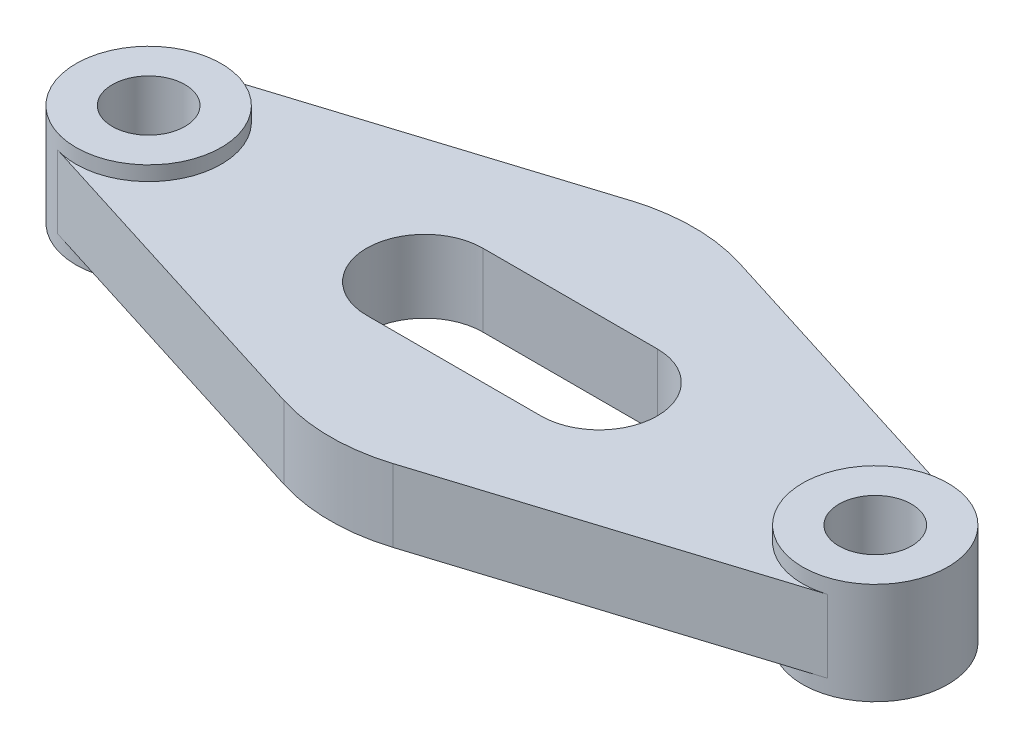
ISO-10303-21;
HEADER;
FILE_DESCRIPTION(('STEP AP214'),'2;1');
FILE_NAME('part.step','',(''),(''),'','','');
FILE_SCHEMA(('AUTOMOTIVE_DESIGN { 1 0 10303 214 1 1 1 1 }'));
ENDSEC;
DATA;
#1=APPLICATION_CONTEXT('core data for automotive mechanical design processes');
#2=APPLICATION_PROTOCOL_DEFINITION('international standard','automotive_design',2000,#1);
#3=PRODUCT_CONTEXT('',#1,'mechanical');
#4=PRODUCT('Part','Part','',(#3));
#5=PRODUCT_RELATED_PRODUCT_CATEGORY('part','',(#4));
#6=PRODUCT_DEFINITION_FORMATION('','',#4);
#7=PRODUCT_DEFINITION_CONTEXT('part definition',#1,'design');
#8=PRODUCT_DEFINITION('design','',#6,#7);
#9=PRODUCT_DEFINITION_SHAPE('','',#8);
#10=(LENGTH_UNIT() NAMED_UNIT(*) SI_UNIT(.MILLI.,.METRE.));
#11=(NAMED_UNIT(*) PLANE_ANGLE_UNIT() SI_UNIT($,.RADIAN.));
#12=(NAMED_UNIT(*) SI_UNIT($,.STERADIAN.) SOLID_ANGLE_UNIT());
#13=UNCERTAINTY_MEASURE_WITH_UNIT(LENGTH_MEASURE(1.E-05),#10,'distance_accuracy_value','');
#14=(GEOMETRIC_REPRESENTATION_CONTEXT(3) GLOBAL_UNCERTAINTY_ASSIGNED_CONTEXT((#13)) GLOBAL_UNIT_ASSIGNED_CONTEXT((#10,
#11,#12)) REPRESENTATION_CONTEXT('',''));
#15=CARTESIAN_POINT('',(0.,0.,0.));
#16=DIRECTION('',(0.,0.,1.));
#17=DIRECTION('',(1.,0.,0.));
#18=AXIS2_PLACEMENT_3D('',#15,#16,#17);
#19=CARTESIAN_POINT('',(-7.50000000000001,-5.,23.8484800354236));
#20=DIRECTION('',(-0.3,0.,0.953939201416946));
#21=DIRECTION('',(0.953939201416946,0.,0.3));
#22=AXIS2_PLACEMENT_3D('',#19,#20,#21);
#23=PLANE('',#22);
#24=DIRECTION('',(0.,1.,0.));
#25=VECTOR('',#24,1.);
#26=CARTESIAN_POINT('',(-7.50000000000001,-5.,23.8484800354236));
#27=LINE('',#26,#25);
#28=CARTESIAN_POINT('',(-7.50000000000001,-5.,23.8484800354236));
#29=VERTEX_POINT('',#28);
#30=CARTESIAN_POINT('',(-7.50000000000001,5.,23.8484800354236));
#31=VERTEX_POINT('',#30);
#32=EDGE_CURVE('E230',#29,#31,#27,.T.);
#33=ORIENTED_EDGE('',*,*,#32,.T.);
#34=DIRECTION('',(0.953939201416946,0.,0.3));
#35=VECTOR('',#34,1.);
#36=CARTESIAN_POINT('',(-7.50000000000001,5.,23.8484800354236));
#37=LINE('',#36,#35);
#38=CARTESIAN_POINT('',(-53.,5.,9.53939201416946));
#39=VERTEX_POINT('',#38);
#40=EDGE_CURVE('E276',#39,#31,#37,.T.);
#41=ORIENTED_EDGE('',*,*,#40,.F.);
#42=DIRECTION('',(0.,1.,0.));
#43=VECTOR('',#42,1.);
#44=CARTESIAN_POINT('',(-53.,-5.,9.53939201416946));
#45=LINE('',#44,#43);
#46=CARTESIAN_POINT('',(-53.,-5.,9.53939201416946));
#47=VERTEX_POINT('',#46);
#48=EDGE_CURVE('E11',#47,#39,#45,.T.);
#49=ORIENTED_EDGE('',*,*,#48,.F.);
#50=DIRECTION('',(0.953939201416946,0.,0.3));
#51=VECTOR('',#50,1.);
#52=CARTESIAN_POINT('',(-7.50000000000001,-5.,23.8484800354236));
#53=LINE('',#52,#51);
#54=EDGE_CURVE('E194',#47,#29,#53,.T.);
#55=ORIENTED_EDGE('',*,*,#54,.T.);
#56=EDGE_LOOP('',(#33,#41,#49,#55));
#57=FACE_BOUND('',#56,.T.);
#58=ADVANCED_FACE('F41',(#57),#23,.T.);
#59=CARTESIAN_POINT('',(-7.5,-5.,-23.8484800354236));
#60=DIRECTION('',(0.3,0.,0.953939201416946));
#61=DIRECTION('',(0.953939201416946,0.,-0.3));
#62=AXIS2_PLACEMENT_3D('',#59,#60,#61);
#63=PLANE('',#62);
#64=DIRECTION('',(0.,1.,0.));
#65=VECTOR('',#64,1.);
#66=CARTESIAN_POINT('',(-53.,-5.,-9.53939201416945));
#67=LINE('',#66,#65);
#68=CARTESIAN_POINT('',(-53.,-5.,-9.53939201416945));
#69=VERTEX_POINT('',#68);
#70=CARTESIAN_POINT('',(-53.,5.,-9.53939201416945));
#71=VERTEX_POINT('',#70);
#72=EDGE_CURVE('E51',#69,#71,#67,.T.);
#73=ORIENTED_EDGE('',*,*,#72,.T.);
#74=DIRECTION('',(0.953939201416946,0.,-0.3));
#75=VECTOR('',#74,1.);
#76=CARTESIAN_POINT('',(-7.5,5.,-23.8484800354236));
#77=LINE('',#76,#75);
#78=CARTESIAN_POINT('',(-7.5,5.,-23.8484800354236));
#79=VERTEX_POINT('',#78);
#80=EDGE_CURVE('E172',#71,#79,#77,.T.);
#81=ORIENTED_EDGE('',*,*,#80,.T.);
#82=DIRECTION('',(0.,1.,0.));
#83=VECTOR('',#82,1.);
#84=CARTESIAN_POINT('',(-7.5,-5.,-23.8484800354236));
#85=LINE('',#84,#83);
#86=CARTESIAN_POINT('',(-7.5,-5.,-23.8484800354236));
#87=VERTEX_POINT('',#86);
#88=EDGE_CURVE('E220',#87,#79,#85,.T.);
#89=ORIENTED_EDGE('',*,*,#88,.F.);
#90=DIRECTION('',(0.953939201416946,0.,-0.3));
#91=VECTOR('',#90,1.);
#92=CARTESIAN_POINT('',(-7.5,-5.,-23.8484800354236));
#93=LINE('',#92,#91);
#94=EDGE_CURVE('E65',#69,#87,#93,.T.);
#95=ORIENTED_EDGE('',*,*,#94,.F.);
#96=EDGE_LOOP('',(#73,#81,#89,#95));
#97=FACE_BOUND('',#96,.T.);
#98=ADVANCED_FACE('F291',(#97),#63,.F.);
#99=CARTESIAN_POINT('',(0.,-5.,0.));
#100=DIRECTION('',(0.,1.,0.));
#101=DIRECTION('',(0.,0.,1.));
#102=AXIS2_PLACEMENT_3D('',#99,#100,#101);
#103=CYLINDRICAL_SURFACE('',#102,25.);
#104=ORIENTED_EDGE('',*,*,#88,.T.);
#105=CARTESIAN_POINT('',(0.,5.,0.));
#106=DIRECTION('',(0.,1.,0.));
#107=DIRECTION('',(0.,0.,1.));
#108=AXIS2_PLACEMENT_3D('',#105,#106,#107);
#109=CIRCLE('',#108,25.);
#110=CARTESIAN_POINT('',(7.5,5.,-23.8484800354236));
#111=VERTEX_POINT('',#110);
#112=EDGE_CURVE('E165',#111,#79,#109,.T.);
#113=ORIENTED_EDGE('',*,*,#112,.F.);
#114=DIRECTION('',(0.,1.,0.));
#115=VECTOR('',#114,1.);
#116=CARTESIAN_POINT('',(7.5,-5.,-23.8484800354236));
#117=LINE('',#116,#115);
#118=CARTESIAN_POINT('',(7.5,-5.,-23.8484800354236));
#119=VERTEX_POINT('',#118);
#120=EDGE_CURVE('E223',#119,#111,#117,.T.);
#121=ORIENTED_EDGE('',*,*,#120,.F.);
#122=CARTESIAN_POINT('',(0.,-5.,0.));
#123=DIRECTION('',(0.,1.,0.));
#124=DIRECTION('',(0.,0.,1.));
#125=AXIS2_PLACEMENT_3D('',#122,#123,#124);
#126=CIRCLE('',#125,25.);
#127=EDGE_CURVE('E209',#119,#87,#126,.T.);
#128=ORIENTED_EDGE('',*,*,#127,.T.);
#129=EDGE_LOOP('',(#104,#113,#121,#128));
#130=FACE_BOUND('',#129,.T.);
#131=ADVANCED_FACE('F316',(#130),#103,.T.);
#132=CARTESIAN_POINT('',(7.5,-5.,-23.8484800354236));
#133=DIRECTION('',(-0.3,0.,0.953939201416946));
#134=DIRECTION('',(0.953939201416946,0.,0.3));
#135=AXIS2_PLACEMENT_3D('',#132,#133,#134);
#136=PLANE('',#135);
#137=ORIENTED_EDGE('',*,*,#120,.T.);
#138=DIRECTION('',(0.953939201416946,0.,0.3));
#139=VECTOR('',#138,1.);
#140=CARTESIAN_POINT('',(7.5,5.,-23.8484800354236));
#141=LINE('',#140,#139);
#142=CARTESIAN_POINT('',(53.,5.,-9.53939201416945));
#143=VERTEX_POINT('',#142);
#144=EDGE_CURVE('E162',#111,#143,#141,.T.);
#145=ORIENTED_EDGE('',*,*,#144,.T.);
#146=DIRECTION('',(0.,1.,0.));
#147=VECTOR('',#146,1.);
#148=CARTESIAN_POINT('',(53.,-5.,-9.53939201416945));
#149=LINE('',#148,#147);
#150=CARTESIAN_POINT('',(53.,-5.,-9.53939201416945));
#151=VERTEX_POINT('',#150);
#152=EDGE_CURVE('E155',#151,#143,#149,.T.);
#153=ORIENTED_EDGE('',*,*,#152,.F.);
#154=DIRECTION('',(0.953939201416946,0.,0.3));
#155=VECTOR('',#154,1.);
#156=CARTESIAN_POINT('',(7.5,-5.,-23.8484800354236));
#157=LINE('',#156,#155);
#158=EDGE_CURVE('E206',#119,#151,#157,.T.);
#159=ORIENTED_EDGE('',*,*,#158,.F.);
#160=EDGE_LOOP('',(#137,#145,#153,#159));
#161=FACE_BOUND('',#160,.T.);
#162=ADVANCED_FACE('F288',(#161),#136,.F.);
#163=CARTESIAN_POINT('',(7.49999999999999,-5.,23.8484800354236));
#164=DIRECTION('',(0.3,0.,0.953939201416946));
#165=DIRECTION('',(0.953939201416946,0.,-0.3));
#166=AXIS2_PLACEMENT_3D('',#163,#164,#165);
#167=PLANE('',#166);
#168=DIRECTION('',(0.,1.,0.));
#169=VECTOR('',#168,1.);
#170=CARTESIAN_POINT('',(53.,-5.,9.53939201416945));
#171=LINE('',#170,#169);
#172=CARTESIAN_POINT('',(53.,-5.,9.53939201416945));
#173=VERTEX_POINT('',#172);
#174=CARTESIAN_POINT('',(53.,5.,9.53939201416946));
#175=VERTEX_POINT('',#174);
#176=EDGE_CURVE('E148',#173,#175,#171,.T.);
#177=ORIENTED_EDGE('',*,*,#176,.T.);
#178=DIRECTION('',(0.953939201416946,0.,-0.3));
#179=VECTOR('',#178,1.);
#180=CARTESIAN_POINT('',(7.49999999999999,5.,23.8484800354236));
#181=LINE('',#180,#179);
#182=CARTESIAN_POINT('',(7.49999999999999,5.,23.8484800354236));
#183=VERTEX_POINT('',#182);
#184=EDGE_CURVE('E133',#183,#175,#181,.T.);
#185=ORIENTED_EDGE('',*,*,#184,.F.);
#186=DIRECTION('',(0.,1.,0.));
#187=VECTOR('',#186,1.);
#188=CARTESIAN_POINT('',(7.49999999999999,-5.,23.8484800354236));
#189=LINE('',#188,#187);
#190=CARTESIAN_POINT('',(7.49999999999999,-5.,23.8484800354236));
#191=VERTEX_POINT('',#190);
#192=EDGE_CURVE('E156',#191,#183,#189,.T.);
#193=ORIENTED_EDGE('',*,*,#192,.F.);
#194=DIRECTION('',(0.953939201416946,0.,-0.3));
#195=VECTOR('',#194,1.);
#196=CARTESIAN_POINT('',(7.49999999999999,-5.,23.8484800354236));
#197=LINE('',#196,#195);
#198=EDGE_CURVE('E151',#191,#173,#197,.T.);
#199=ORIENTED_EDGE('',*,*,#198,.T.);
#200=EDGE_LOOP('',(#177,#185,#193,#199));
#201=FACE_BOUND('',#200,.T.);
#202=ADVANCED_FACE('F149',(#201),#167,.T.);
#203=CARTESIAN_POINT('',(-12.,-5.,0.));
#204=DIRECTION('',(0.,1.,0.));
#205=DIRECTION('',(0.,0.,1.));
#206=AXIS2_PLACEMENT_3D('',#203,#204,#205);
#207=CYLINDRICAL_SURFACE('',#206,8.);
#208=DIRECTION('',(0.,1.,0.));
#209=VECTOR('',#208,1.);
#210=CARTESIAN_POINT('',(-12.,-5.,-8.));
#211=LINE('',#210,#209);
#212=CARTESIAN_POINT('',(-12.,-5.,-8.));
#213=VERTEX_POINT('',#212);
#214=CARTESIAN_POINT('',(-12.,5.,-8.));
#215=VERTEX_POINT('',#214);
#216=EDGE_CURVE('E45',#213,#215,#211,.T.);
#217=ORIENTED_EDGE('',*,*,#216,.T.);
#218=CARTESIAN_POINT('',(-12.,5.,0.));
#219=DIRECTION('',(0.,1.,0.));
#220=DIRECTION('',(0.,0.,1.));
#221=AXIS2_PLACEMENT_3D('',#218,#219,#220);
#222=CIRCLE('',#221,8.);
#223=CARTESIAN_POINT('',(-12.,5.,8.));
#224=VERTEX_POINT('',#223);
#225=EDGE_CURVE('E250',#215,#224,#222,.T.);
#226=ORIENTED_EDGE('',*,*,#225,.T.);
#227=DIRECTION('',(0.,1.,0.));
#228=VECTOR('',#227,1.);
#229=CARTESIAN_POINT('',(-12.,-5.,8.));
#230=LINE('',#229,#228);
#231=CARTESIAN_POINT('',(-12.,-5.,8.));
#232=VERTEX_POINT('',#231);
#233=EDGE_CURVE('E233',#232,#224,#230,.T.);
#234=ORIENTED_EDGE('',*,*,#233,.F.);
#235=CARTESIAN_POINT('',(-12.,-5.,0.));
#236=DIRECTION('',(0.,1.,0.));
#237=DIRECTION('',(0.,0.,1.));
#238=AXIS2_PLACEMENT_3D('',#235,#236,#237);
#239=CIRCLE('',#238,8.);
#240=EDGE_CURVE('E180',#213,#232,#239,.T.);
#241=ORIENTED_EDGE('',*,*,#240,.F.);
#242=EDGE_LOOP('',(#217,#226,#234,#241));
#243=FACE_BOUND('',#242,.T.);
#244=ADVANCED_FACE('F43',(#243),#207,.F.);
#245=CARTESIAN_POINT('',(0.,-5.,8.));
#246=DIRECTION('',(0.,0.,1.));
#247=DIRECTION('',(1.,0.,0.));
#248=AXIS2_PLACEMENT_3D('',#245,#246,#247);
#249=PLANE('',#248);
#250=ORIENTED_EDGE('',*,*,#233,.T.);
#251=DIRECTION('',(1.,0.,0.));
#252=VECTOR('',#251,1.);
#253=CARTESIAN_POINT('',(0.,5.,8.));
#254=LINE('',#253,#252);
#255=CARTESIAN_POINT('',(12.,5.,8.));
#256=VERTEX_POINT('',#255);
#257=EDGE_CURVE('E262',#224,#256,#254,.T.);
#258=ORIENTED_EDGE('',*,*,#257,.T.);
#259=DIRECTION('',(0.,1.,0.));
#260=VECTOR('',#259,1.);
#261=CARTESIAN_POINT('',(12.,-5.,8.));
#262=LINE('',#261,#260);
#263=CARTESIAN_POINT('',(12.,-5.,8.));
#264=VERTEX_POINT('',#263);
#265=EDGE_CURVE('E236',#264,#256,#262,.T.);
#266=ORIENTED_EDGE('',*,*,#265,.F.);
#267=DIRECTION('',(1.,0.,0.));
#268=VECTOR('',#267,1.);
#269=CARTESIAN_POINT('',(0.,-5.,8.));
#270=LINE('',#269,#268);
#271=EDGE_CURVE('E191',#232,#264,#270,.T.);
#272=ORIENTED_EDGE('',*,*,#271,.F.);
#273=EDGE_LOOP('',(#250,#258,#266,#272));
#274=FACE_BOUND('',#273,.T.);
#275=ADVANCED_FACE('F321',(#274),#249,.F.);
#276=CARTESIAN_POINT('',(12.,-5.,0.));
#277=DIRECTION('',(0.,1.,0.));
#278=DIRECTION('',(0.,0.,1.));
#279=AXIS2_PLACEMENT_3D('',#276,#277,#278);
#280=CYLINDRICAL_SURFACE('',#279,8.);
#281=ORIENTED_EDGE('',*,*,#265,.T.);
#282=CARTESIAN_POINT('',(12.,5.,0.));
#283=DIRECTION('',(0.,1.,0.));
#284=DIRECTION('',(0.,0.,1.));
#285=AXIS2_PLACEMENT_3D('',#282,#283,#284);
#286=CIRCLE('',#285,8.);
#287=CARTESIAN_POINT('',(12.,5.,-8.));
#288=VERTEX_POINT('',#287);
#289=EDGE_CURVE('E259',#256,#288,#286,.T.);
#290=ORIENTED_EDGE('',*,*,#289,.T.);
#291=DIRECTION('',(0.,1.,0.));
#292=VECTOR('',#291,1.);
#293=CARTESIAN_POINT('',(12.,-5.,-8.));
#294=LINE('',#293,#292);
#295=CARTESIAN_POINT('',(12.,-5.,-8.));
#296=VERTEX_POINT('',#295);
#297=EDGE_CURVE('E238',#296,#288,#294,.T.);
#298=ORIENTED_EDGE('',*,*,#297,.F.);
#299=CARTESIAN_POINT('',(12.,-5.,0.));
#300=DIRECTION('',(0.,1.,0.));
#301=DIRECTION('',(0.,0.,1.));
#302=AXIS2_PLACEMENT_3D('',#299,#300,#301);
#303=CIRCLE('',#302,8.);
#304=EDGE_CURVE('E188',#264,#296,#303,.T.);
#305=ORIENTED_EDGE('',*,*,#304,.F.);
#306=EDGE_LOOP('',(#281,#290,#298,#305));
#307=FACE_BOUND('',#306,.T.);
#308=ADVANCED_FACE('F324',(#307),#280,.F.);
#309=CARTESIAN_POINT('',(0.,-5.,-8.));
#310=DIRECTION('',(0.,0.,1.));
#311=DIRECTION('',(1.,0.,0.));
#312=AXIS2_PLACEMENT_3D('',#309,#310,#311);
#313=PLANE('',#312);
#314=ORIENTED_EDGE('',*,*,#297,.T.);
#315=DIRECTION('',(1.,0.,0.));
#316=VECTOR('',#315,1.);
#317=CARTESIAN_POINT('',(0.,5.,-8.));
#318=LINE('',#317,#316);
#319=EDGE_CURVE('E253',#215,#288,#318,.T.);
#320=ORIENTED_EDGE('',*,*,#319,.F.);
#321=ORIENTED_EDGE('',*,*,#216,.F.);
#322=DIRECTION('',(1.,0.,0.));
#323=VECTOR('',#322,1.);
#324=CARTESIAN_POINT('',(0.,-5.,-8.));
#325=LINE('',#324,#323);
#326=EDGE_CURVE('E184',#213,#296,#325,.T.);
#327=ORIENTED_EDGE('',*,*,#326,.T.);
#328=EDGE_LOOP('',(#314,#320,#321,#327));
#329=FACE_BOUND('',#328,.T.);
#330=ADVANCED_FACE('F254',(#329),#313,.T.);
#331=CARTESIAN_POINT('',(0.,-5.,0.));
#332=DIRECTION('',(0.,1.,0.));
#333=DIRECTION('',(0.,0.,1.));
#334=AXIS2_PLACEMENT_3D('',#331,#332,#333);
#335=CYLINDRICAL_SURFACE('',#334,25.);
#336=ORIENTED_EDGE('',*,*,#192,.T.);
#337=CARTESIAN_POINT('',(0.,5.,0.));
#338=DIRECTION('',(0.,1.,0.));
#339=DIRECTION('',(0.,0.,1.));
#340=AXIS2_PLACEMENT_3D('',#337,#338,#339);
#341=CIRCLE('',#340,25.);
#342=EDGE_CURVE('E142',#31,#183,#341,.T.);
#343=ORIENTED_EDGE('',*,*,#342,.F.);
#344=ORIENTED_EDGE('',*,*,#32,.F.);
#345=CARTESIAN_POINT('',(0.,-5.,0.));
#346=DIRECTION('',(0.,1.,0.));
#347=DIRECTION('',(0.,0.,1.));
#348=AXIS2_PLACEMENT_3D('',#345,#346,#347);
#349=CIRCLE('',#348,25.);
#350=EDGE_CURVE('E197',#29,#191,#349,.T.);
#351=ORIENTED_EDGE('',*,*,#350,.T.);
#352=EDGE_LOOP('',(#336,#343,#344,#351));
#353=FACE_BOUND('',#352,.T.);
#354=ADVANCED_FACE('F282',(#353),#335,.T.);
#355=CARTESIAN_POINT('',(0.,-5.,0.));
#356=DIRECTION('',(0.,1.,0.));
#357=DIRECTION('',(0.,0.,1.));
#358=AXIS2_PLACEMENT_3D('',#355,#356,#357);
#359=PLANE('',#358);
#360=ORIENTED_EDGE('',*,*,#240,.T.);
#361=ORIENTED_EDGE('',*,*,#271,.T.);
#362=ORIENTED_EDGE('',*,*,#304,.T.);
#363=ORIENTED_EDGE('',*,*,#326,.F.);
#364=EDGE_LOOP('',(#360,#361,#362,#363));
#365=FACE_BOUND('',#364,.T.);
#366=ORIENTED_EDGE('',*,*,#54,.F.);
#367=CARTESIAN_POINT('',(-50.,-5.,0.));
#368=DIRECTION('',(0.,1.,0.));
#369=DIRECTION('',(0.,0.,1.));
#370=AXIS2_PLACEMENT_3D('',#367,#368,#369);
#371=CIRCLE('',#370,10.);
#372=EDGE_CURVE('E215',#47,#69,#371,.T.);
#373=ORIENTED_EDGE('',*,*,#372,.T.);
#374=ORIENTED_EDGE('',*,*,#94,.T.);
#375=ORIENTED_EDGE('',*,*,#127,.F.);
#376=ORIENTED_EDGE('',*,*,#158,.T.);
#377=CARTESIAN_POINT('',(50.,-5.,0.));
#378=DIRECTION('',(0.,1.,0.));
#379=DIRECTION('',(0.,0.,1.));
#380=AXIS2_PLACEMENT_3D('',#377,#378,#379);
#381=CIRCLE('',#380,10.);
#382=EDGE_CURVE('E203',#151,#173,#381,.T.);
#383=ORIENTED_EDGE('',*,*,#382,.T.);
#384=ORIENTED_EDGE('',*,*,#198,.F.);
#385=ORIENTED_EDGE('',*,*,#350,.F.);
#386=EDGE_LOOP('',(#366,#373,#374,#375,#376,#383,#384,#385));
#387=FACE_BOUND('',#386,.T.);
#388=ADVANCED_FACE('F284',(#365,#387),#359,.F.);
#389=CARTESIAN_POINT('',(0.,5.,0.));
#390=DIRECTION('',(0.,1.,0.));
#391=DIRECTION('',(0.,0.,1.));
#392=AXIS2_PLACEMENT_3D('',#389,#390,#391);
#393=PLANE('',#392);
#394=ORIENTED_EDGE('',*,*,#225,.F.);
#395=ORIENTED_EDGE('',*,*,#319,.T.);
#396=ORIENTED_EDGE('',*,*,#289,.F.);
#397=ORIENTED_EDGE('',*,*,#257,.F.);
#398=EDGE_LOOP('',(#394,#395,#396,#397));
#399=FACE_BOUND('',#398,.T.);
#400=ORIENTED_EDGE('',*,*,#40,.T.);
#401=ORIENTED_EDGE('',*,*,#342,.T.);
#402=ORIENTED_EDGE('',*,*,#184,.T.);
#403=CARTESIAN_POINT('',(50.,5.,0.));
#404=DIRECTION('',(0.,1.,0.));
#405=DIRECTION('',(0.,0.,1.));
#406=AXIS2_PLACEMENT_3D('',#403,#404,#405);
#407=CIRCLE('',#406,10.);
#408=EDGE_CURVE('E139',#143,#175,#407,.T.);
#409=ORIENTED_EDGE('',*,*,#408,.F.);
#410=ORIENTED_EDGE('',*,*,#144,.F.);
#411=ORIENTED_EDGE('',*,*,#112,.T.);
#412=ORIENTED_EDGE('',*,*,#80,.F.);
#413=CARTESIAN_POINT('',(-50.,5.,0.));
#414=DIRECTION('',(0.,1.,0.));
#415=DIRECTION('',(0.,0.,1.));
#416=AXIS2_PLACEMENT_3D('',#413,#414,#415);
#417=CIRCLE('',#416,10.);
#418=EDGE_CURVE('E176',#39,#71,#417,.T.);
#419=ORIENTED_EDGE('',*,*,#418,.F.);
#420=EDGE_LOOP('',(#400,#401,#402,#409,#410,#411,#412,#419));
#421=FACE_BOUND('',#420,.T.);
#422=ADVANCED_FACE('F136',(#399,#421),#393,.T.);
#423=CARTESIAN_POINT('',(-50.,-7.,0.));
#424=DIRECTION('',(0.,1.,0.));
#425=DIRECTION('',(0.,0.,1.));
#426=AXIS2_PLACEMENT_3D('',#423,#424,#425);
#427=CYLINDRICAL_SURFACE('',#426,10.);
#428=CARTESIAN_POINT('',(-50.,7.,0.));
#429=DIRECTION('',(0.,1.,0.));
#430=DIRECTION('',(0.,0.,1.));
#431=AXIS2_PLACEMENT_3D('',#428,#429,#430);
#432=CIRCLE('',#431,10.);
#433=CARTESIAN_POINT('',(-50.,7.,10.));
#434=VERTEX_POINT('',#433);
#435=EDGE_CURVE('E492',#434,#434,#432,.T.);
#436=ORIENTED_EDGE('',*,*,#435,.F.);
#437=EDGE_LOOP('',(#436));
#438=FACE_BOUND('',#437,.T.);
#439=CARTESIAN_POINT('',(-50.,-7.,0.));
#440=DIRECTION('',(0.,1.,0.));
#441=DIRECTION('',(0.,0.,1.));
#442=AXIS2_PLACEMENT_3D('',#439,#440,#441);
#443=CIRCLE('',#442,10.);
#444=CARTESIAN_POINT('',(-50.,-7.,10.));
#445=VERTEX_POINT('',#444);
#446=EDGE_CURVE('E264',#445,#445,#443,.T.);
#447=ORIENTED_EDGE('',*,*,#446,.T.);
#448=EDGE_LOOP('',(#447));
#449=FACE_BOUND('',#448,.T.);
#450=ORIENTED_EDGE('',*,*,#372,.F.);
#451=ORIENTED_EDGE('',*,*,#48,.T.);
#452=ORIENTED_EDGE('',*,*,#418,.T.);
#453=ORIENTED_EDGE('',*,*,#72,.F.);
#454=EDGE_LOOP('',(#450,#451,#452,#453));
#455=FACE_BOUND('',#454,.T.);
#456=ADVANCED_FACE('F295',(#438,#449,#455),#427,.T.);
#457=CARTESIAN_POINT('',(-50.,-7.,0.));
#458=DIRECTION('',(0.,1.,0.));
#459=DIRECTION('',(0.,0.,1.));
#460=AXIS2_PLACEMENT_3D('',#457,#458,#459);
#461=CYLINDRICAL_SURFACE('',#460,5.);
#462=CARTESIAN_POINT('',(-50.,-7.,0.));
#463=DIRECTION('',(0.,1.,0.));
#464=DIRECTION('',(0.,0.,1.));
#465=AXIS2_PLACEMENT_3D('',#462,#463,#464);
#466=CIRCLE('',#465,5.);
#467=CARTESIAN_POINT('',(-50.,-7.,5.));
#468=VERTEX_POINT('',#467);
#469=EDGE_CURVE('E268',#468,#468,#466,.T.);
#470=ORIENTED_EDGE('',*,*,#469,.F.);
#471=EDGE_LOOP('',(#470));
#472=FACE_BOUND('',#471,.T.);
#473=CARTESIAN_POINT('',(-50.,7.,0.));
#474=DIRECTION('',(0.,1.,0.));
#475=DIRECTION('',(0.,0.,1.));
#476=AXIS2_PLACEMENT_3D('',#473,#474,#475);
#477=CIRCLE('',#476,5.);
#478=CARTESIAN_POINT('',(-50.,7.,5.));
#479=VERTEX_POINT('',#478);
#480=EDGE_CURVE('E488',#479,#479,#477,.T.);
#481=ORIENTED_EDGE('',*,*,#480,.T.);
#482=EDGE_LOOP('',(#481));
#483=FACE_BOUND('',#482,.T.);
#484=ADVANCED_FACE('F297',(#472,#483),#461,.F.);
#485=CARTESIAN_POINT('',(0.,-7.,0.));
#486=DIRECTION('',(0.,1.,0.));
#487=DIRECTION('',(0.,0.,1.));
#488=AXIS2_PLACEMENT_3D('',#485,#486,#487);
#489=PLANE('',#488);
#490=ORIENTED_EDGE('',*,*,#469,.T.);
#491=EDGE_LOOP('',(#490));
#492=FACE_BOUND('',#491,.T.);
#493=ORIENTED_EDGE('',*,*,#446,.F.);
#494=EDGE_LOOP('',(#493));
#495=FACE_BOUND('',#494,.T.);
#496=ADVANCED_FACE('F304',(#492,#495),#489,.F.);
#497=CARTESIAN_POINT('',(0.,7.,0.));
#498=DIRECTION('',(0.,1.,0.));
#499=DIRECTION('',(0.,0.,1.));
#500=AXIS2_PLACEMENT_3D('',#497,#498,#499);
#501=PLANE('',#500);
#502=ORIENTED_EDGE('',*,*,#480,.F.);
#503=EDGE_LOOP('',(#502));
#504=FACE_BOUND('',#503,.T.);
#505=ORIENTED_EDGE('',*,*,#435,.T.);
#506=EDGE_LOOP('',(#505));
#507=FACE_BOUND('',#506,.T.);
#508=ADVANCED_FACE('F416',(#504,#507),#501,.T.);
#509=CARTESIAN_POINT('',(50.,-7.,0.));
#510=DIRECTION('',(0.,1.,0.));
#511=DIRECTION('',(0.,0.,1.));
#512=AXIS2_PLACEMENT_3D('',#509,#510,#511);
#513=CYLINDRICAL_SURFACE('',#512,10.);
#514=CARTESIAN_POINT('',(50.,7.,0.));
#515=DIRECTION('',(0.,1.,0.));
#516=DIRECTION('',(0.,0.,1.));
#517=AXIS2_PLACEMENT_3D('',#514,#515,#516);
#518=CIRCLE('',#517,10.);
#519=CARTESIAN_POINT('',(50.,7.,10.));
#520=VERTEX_POINT('',#519);
#521=EDGE_CURVE('E474',#520,#520,#518,.T.);
#522=ORIENTED_EDGE('',*,*,#521,.F.);
#523=EDGE_LOOP('',(#522));
#524=FACE_BOUND('',#523,.T.);
#525=CARTESIAN_POINT('',(50.,-7.,0.));
#526=DIRECTION('',(0.,1.,0.));
#527=DIRECTION('',(0.,0.,1.));
#528=AXIS2_PLACEMENT_3D('',#525,#526,#527);
#529=CIRCLE('',#528,10.);
#530=CARTESIAN_POINT('',(50.,-7.,10.));
#531=VERTEX_POINT('',#530);
#532=EDGE_CURVE('E481',#531,#531,#529,.T.);
#533=ORIENTED_EDGE('',*,*,#532,.T.);
#534=EDGE_LOOP('',(#533));
#535=FACE_BOUND('',#534,.T.);
#536=ORIENTED_EDGE('',*,*,#382,.F.);
#537=ORIENTED_EDGE('',*,*,#152,.T.);
#538=ORIENTED_EDGE('',*,*,#408,.T.);
#539=ORIENTED_EDGE('',*,*,#176,.F.);
#540=EDGE_LOOP('',(#536,#537,#538,#539));
#541=FACE_BOUND('',#540,.T.);
#542=ADVANCED_FACE('F159',(#524,#535,#541),#513,.T.);
#543=CARTESIAN_POINT('',(50.,-7.,0.));
#544=DIRECTION('',(0.,1.,0.));
#545=DIRECTION('',(0.,0.,1.));
#546=AXIS2_PLACEMENT_3D('',#543,#544,#545);
#547=CYLINDRICAL_SURFACE('',#546,5.);
#548=CARTESIAN_POINT('',(50.,-7.,0.));
#549=DIRECTION('',(0.,1.,0.));
#550=DIRECTION('',(0.,0.,1.));
#551=AXIS2_PLACEMENT_3D('',#548,#549,#550);
#552=CIRCLE('',#551,5.);
#553=CARTESIAN_POINT('',(50.,-7.,5.));
#554=VERTEX_POINT('',#553);
#555=EDGE_CURVE('E476',#554,#554,#552,.T.);
#556=ORIENTED_EDGE('',*,*,#555,.F.);
#557=EDGE_LOOP('',(#556));
#558=FACE_BOUND('',#557,.T.);
#559=CARTESIAN_POINT('',(50.,7.,0.));
#560=DIRECTION('',(0.,1.,0.));
#561=DIRECTION('',(0.,0.,1.));
#562=AXIS2_PLACEMENT_3D('',#559,#560,#561);
#563=CIRCLE('',#562,5.);
#564=CARTESIAN_POINT('',(50.,7.,5.));
#565=VERTEX_POINT('',#564);
#566=EDGE_CURVE('E471',#565,#565,#563,.T.);
#567=ORIENTED_EDGE('',*,*,#566,.T.);
#568=EDGE_LOOP('',(#567));
#569=FACE_BOUND('',#568,.T.);
#570=ADVANCED_FACE('F434',(#558,#569),#547,.F.);
#571=CARTESIAN_POINT('',(0.,-7.,0.));
#572=DIRECTION('',(0.,1.,0.));
#573=DIRECTION('',(0.,0.,1.));
#574=AXIS2_PLACEMENT_3D('',#571,#572,#573);
#575=PLANE('',#574);
#576=ORIENTED_EDGE('',*,*,#555,.T.);
#577=EDGE_LOOP('',(#576));
#578=FACE_BOUND('',#577,.T.);
#579=ORIENTED_EDGE('',*,*,#532,.F.);
#580=EDGE_LOOP('',(#579));
#581=FACE_BOUND('',#580,.T.);
#582=ADVANCED_FACE('F444',(#578,#581),#575,.F.);
#583=CARTESIAN_POINT('',(0.,7.,0.));
#584=DIRECTION('',(0.,1.,0.));
#585=DIRECTION('',(0.,0.,1.));
#586=AXIS2_PLACEMENT_3D('',#583,#584,#585);
#587=PLANE('',#586);
#588=ORIENTED_EDGE('',*,*,#566,.F.);
#589=EDGE_LOOP('',(#588));
#590=FACE_BOUND('',#589,.T.);
#591=ORIENTED_EDGE('',*,*,#521,.T.);
#592=EDGE_LOOP('',(#591));
#593=FACE_BOUND('',#592,.T.);
#594=ADVANCED_FACE('F454',(#590,#593),#587,.T.);
#595=CLOSED_SHELL('',(#58,#98,#131,#162,#202,#244,#275,#308,#330,#354,#388,#422,#456,#484,#496,
#508,#542,#570,#582,#594));
#596=MANIFOLD_SOLID_BREP('B2',#595);
#597=ADVANCED_BREP_SHAPE_REPRESENTATION('',(#18,#596),#14);
#598=SHAPE_DEFINITION_REPRESENTATION(#9,#597);
ENDSEC;
END-ISO-10303-21;
